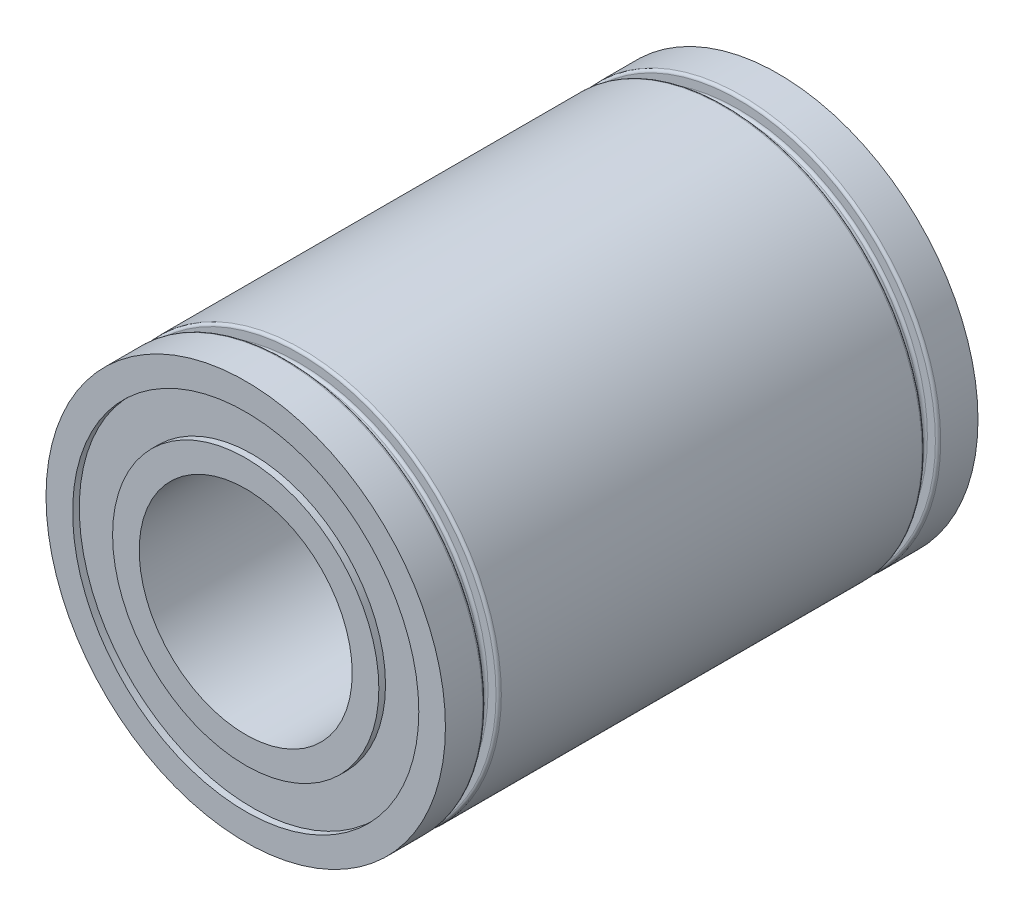
ISO-10303-21;
HEADER;
FILE_DESCRIPTION(('STEP AP214'),'2;1');
FILE_NAME('part.step','',(''),(''),'','','');
FILE_SCHEMA(('AUTOMOTIVE_DESIGN { 1 0 10303 214 1 1 1 1 }'));
ENDSEC;
DATA;
#1=APPLICATION_CONTEXT('core data for automotive mechanical design processes');
#2=APPLICATION_PROTOCOL_DEFINITION('international standard','automotive_design',2000,#1);
#3=PRODUCT_CONTEXT('',#1,'mechanical');
#4=PRODUCT('Part','Part','',(#3));
#5=PRODUCT_RELATED_PRODUCT_CATEGORY('part','',(#4));
#6=PRODUCT_DEFINITION_FORMATION('','',#4);
#7=PRODUCT_DEFINITION_CONTEXT('part definition',#1,'design');
#8=PRODUCT_DEFINITION('design','',#6,#7);
#9=PRODUCT_DEFINITION_SHAPE('','',#8);
#10=(LENGTH_UNIT() NAMED_UNIT(*) SI_UNIT(.MILLI.,.METRE.));
#11=(NAMED_UNIT(*) PLANE_ANGLE_UNIT() SI_UNIT($,.RADIAN.));
#12=(NAMED_UNIT(*) SI_UNIT($,.STERADIAN.) SOLID_ANGLE_UNIT());
#13=UNCERTAINTY_MEASURE_WITH_UNIT(LENGTH_MEASURE(1.E-05),#10,'distance_accuracy_value','');
#14=(GEOMETRIC_REPRESENTATION_CONTEXT(3) GLOBAL_UNCERTAINTY_ASSIGNED_CONTEXT((#13)) GLOBAL_UNIT_ASSIGNED_CONTEXT((#10,
#11,#12)) REPRESENTATION_CONTEXT('',''));
#15=CARTESIAN_POINT('',(0.,0.,0.));
#16=DIRECTION('',(0.,0.,1.));
#17=DIRECTION('',(1.,0.,0.));
#18=AXIS2_PLACEMENT_3D('',#15,#16,#17);
#19=CARTESIAN_POINT('',(0.,0.,10.));
#20=DIRECTION('',(0.,0.,-1.));
#21=DIRECTION('',(-1.,0.,0.));
#22=AXIS2_PLACEMENT_3D('',#19,#20,#21);
#23=CYLINDRICAL_SURFACE('',#22,7.5);
#24=CARTESIAN_POINT('',(0.,0.,-8.6));
#25=DIRECTION('',(0.,0.,1.));
#26=DIRECTION('',(1.,0.,0.));
#27=AXIS2_PLACEMENT_3D('',#24,#25,#26);
#28=CIRCLE('',#27,7.5);
#29=CARTESIAN_POINT('',(7.5,0.,-8.6));
#30=VERTEX_POINT('',#29);
#31=EDGE_CURVE('E93',#30,#30,#28,.F.);
#32=ORIENTED_EDGE('',*,*,#31,.T.);
#33=EDGE_LOOP('',(#32));
#34=FACE_BOUND('',#33,.T.);
#35=CARTESIAN_POINT('',(0.,0.,-10.));
#36=DIRECTION('',(0.,0.,1.));
#37=DIRECTION('',(1.,0.,0.));
#38=AXIS2_PLACEMENT_3D('',#35,#36,#37);
#39=CIRCLE('',#38,7.5);
#40=CARTESIAN_POINT('',(7.5,0.,-10.));
#41=VERTEX_POINT('',#40);
#42=EDGE_CURVE('E133',#41,#41,#39,.T.);
#43=ORIENTED_EDGE('',*,*,#42,.T.);
#44=EDGE_LOOP('',(#43));
#45=FACE_BOUND('',#44,.T.);
#46=ADVANCED_FACE('F52',(#34,#45),#23,.T.);
#47=CARTESIAN_POINT('',(0.,0.,8.6));
#48=DIRECTION('',(0.,0.,-1.));
#49=DIRECTION('',(-1.,0.,0.));
#50=AXIS2_PLACEMENT_3D('',#47,#48,#49);
#51=CIRCLE('',#50,7.5);
#52=CARTESIAN_POINT('',(-7.5,0.,8.6));
#53=VERTEX_POINT('',#52);
#54=EDGE_CURVE('E13',#53,#53,#51,.F.);
#55=ORIENTED_EDGE('',*,*,#54,.T.);
#56=EDGE_LOOP('',(#55));
#57=FACE_BOUND('',#56,.T.);
#58=CARTESIAN_POINT('',(0.,0.,10.));
#59=DIRECTION('',(0.,0.,1.));
#60=DIRECTION('',(1.,0.,0.));
#61=AXIS2_PLACEMENT_3D('',#58,#59,#60);
#62=CIRCLE('',#61,7.5);
#63=CARTESIAN_POINT('',(7.5,0.,10.));
#64=VERTEX_POINT('',#63);
#65=EDGE_CURVE('E132',#64,#64,#62,.T.);
#66=ORIENTED_EDGE('',*,*,#65,.F.);
#67=EDGE_LOOP('',(#66));
#68=FACE_BOUND('',#67,.T.);
#69=ADVANCED_FACE('F154',(#57,#68),#23,.T.);
#70=CARTESIAN_POINT('',(0.,0.,10.));
#71=DIRECTION('',(0.,0.,-1.));
#72=DIRECTION('',(-1.,0.,0.));
#73=AXIS2_PLACEMENT_3D('',#70,#71,#72);
#74=CYLINDRICAL_SURFACE('',#73,5.);
#75=CARTESIAN_POINT('',(0.,0.,-10.));
#76=DIRECTION('',(0.,0.,1.));
#77=DIRECTION('',(1.,0.,0.));
#78=AXIS2_PLACEMENT_3D('',#75,#76,#77);
#79=CIRCLE('',#78,5.);
#80=CARTESIAN_POINT('',(5.,0.,-10.));
#81=VERTEX_POINT('',#80);
#82=EDGE_CURVE('E112',#81,#81,#79,.T.);
#83=ORIENTED_EDGE('',*,*,#82,.T.);
#84=EDGE_LOOP('',(#83));
#85=FACE_BOUND('',#84,.T.);
#86=CARTESIAN_POINT('',(0.,0.,-9.75));
#87=DIRECTION('',(0.,0.,1.));
#88=DIRECTION('',(1.,0.,0.));
#89=AXIS2_PLACEMENT_3D('',#86,#87,#88);
#90=CIRCLE('',#89,5.);
#91=CARTESIAN_POINT('',(5.,0.,-9.75));
#92=VERTEX_POINT('',#91);
#93=EDGE_CURVE('E108',#92,#92,#90,.T.);
#94=ORIENTED_EDGE('',*,*,#93,.F.);
#95=EDGE_LOOP('',(#94));
#96=FACE_BOUND('',#95,.T.);
#97=ADVANCED_FACE('F156',(#85,#96),#74,.T.);
#98=CARTESIAN_POINT('',(0.,0.,10.));
#99=DIRECTION('',(0.,0.,-1.));
#100=DIRECTION('',(-1.,0.,0.));
#101=AXIS2_PLACEMENT_3D('',#98,#99,#100);
#102=CYLINDRICAL_SURFACE('',#101,4.);
#103=CARTESIAN_POINT('',(0.,0.,10.));
#104=DIRECTION('',(0.,0.,1.));
#105=DIRECTION('',(1.,0.,0.));
#106=AXIS2_PLACEMENT_3D('',#103,#104,#105);
#107=CIRCLE('',#106,4.);
#108=CARTESIAN_POINT('',(4.,0.,10.));
#109=VERTEX_POINT('',#108);
#110=EDGE_CURVE('E115',#109,#109,#107,.T.);
#111=ORIENTED_EDGE('',*,*,#110,.T.);
#112=EDGE_LOOP('',(#111));
#113=FACE_BOUND('',#112,.T.);
#114=CARTESIAN_POINT('',(0.,0.,-10.));
#115=DIRECTION('',(0.,0.,1.));
#116=DIRECTION('',(1.,0.,0.));
#117=AXIS2_PLACEMENT_3D('',#114,#115,#116);
#118=CIRCLE('',#117,4.);
#119=CARTESIAN_POINT('',(4.,0.,-10.));
#120=VERTEX_POINT('',#119);
#121=EDGE_CURVE('E116',#120,#120,#118,.T.);
#122=ORIENTED_EDGE('',*,*,#121,.F.);
#123=EDGE_LOOP('',(#122));
#124=FACE_BOUND('',#123,.T.);
#125=ADVANCED_FACE('F163',(#113,#124),#102,.F.);
#126=CARTESIAN_POINT('',(0.,0.,9.75));
#127=DIRECTION('',(0.,0.,1.));
#128=DIRECTION('',(1.,0.,0.));
#129=AXIS2_PLACEMENT_3D('',#126,#127,#128);
#130=CIRCLE('',#129,5.);
#131=CARTESIAN_POINT('',(5.,0.,9.75));
#132=VERTEX_POINT('',#131);
#133=EDGE_CURVE('E119',#132,#132,#130,.T.);
#134=ORIENTED_EDGE('',*,*,#133,.T.);
#135=EDGE_LOOP('',(#134));
#136=FACE_BOUND('',#135,.T.);
#137=CARTESIAN_POINT('',(0.,0.,10.));
#138=DIRECTION('',(0.,0.,1.));
#139=DIRECTION('',(1.,0.,0.));
#140=AXIS2_PLACEMENT_3D('',#137,#138,#139);
#141=CIRCLE('',#140,5.);
#142=CARTESIAN_POINT('',(5.,0.,10.));
#143=VERTEX_POINT('',#142);
#144=EDGE_CURVE('E111',#143,#143,#141,.T.);
#145=ORIENTED_EDGE('',*,*,#144,.F.);
#146=EDGE_LOOP('',(#145));
#147=FACE_BOUND('',#146,.T.);
#148=ADVANCED_FACE('F166',(#136,#147),#74,.T.);
#149=CARTESIAN_POINT('',(0.,0.,10.));
#150=DIRECTION('',(0.,0.,1.));
#151=DIRECTION('',(1.,0.,0.));
#152=AXIS2_PLACEMENT_3D('',#149,#150,#151);
#153=PLANE('',#152);
#154=ORIENTED_EDGE('',*,*,#110,.F.);
#155=EDGE_LOOP('',(#154));
#156=FACE_BOUND('',#155,.T.);
#157=ORIENTED_EDGE('',*,*,#144,.T.);
#158=EDGE_LOOP('',(#157));
#159=FACE_BOUND('',#158,.T.);
#160=ADVANCED_FACE('F387',(#156,#159),#153,.T.);
#161=CARTESIAN_POINT('',(0.,0.,-10.));
#162=DIRECTION('',(0.,0.,1.));
#163=DIRECTION('',(1.,0.,0.));
#164=AXIS2_PLACEMENT_3D('',#161,#162,#163);
#165=PLANE('',#164);
#166=ORIENTED_EDGE('',*,*,#121,.T.);
#167=EDGE_LOOP('',(#166));
#168=FACE_BOUND('',#167,.T.);
#169=ORIENTED_EDGE('',*,*,#82,.F.);
#170=EDGE_LOOP('',(#169));
#171=FACE_BOUND('',#170,.T.);
#172=ADVANCED_FACE('F350',(#168,#171),#165,.F.);
#173=CARTESIAN_POINT('',(0.,0.,9.75));
#174=DIRECTION('',(0.,0.,1.));
#175=DIRECTION('',(1.,0.,0.));
#176=AXIS2_PLACEMENT_3D('',#173,#174,#175);
#177=PLANE('',#176);
#178=ORIENTED_EDGE('',*,*,#133,.F.);
#179=EDGE_LOOP('',(#178));
#180=FACE_BOUND('',#179,.T.);
#181=CARTESIAN_POINT('',(0.,0.,9.75));
#182=DIRECTION('',(0.,0.,1.));
#183=DIRECTION('',(1.,0.,0.));
#184=AXIS2_PLACEMENT_3D('',#181,#182,#183);
#185=CIRCLE('',#184,6.5);
#186=CARTESIAN_POINT('',(6.5,0.,9.75));
#187=VERTEX_POINT('',#186);
#188=EDGE_CURVE('E127',#187,#187,#185,.F.);
#189=ORIENTED_EDGE('',*,*,#188,.F.);
#190=EDGE_LOOP('',(#189));
#191=FACE_BOUND('',#190,.T.);
#192=ADVANCED_FACE('F340',(#180,#191),#177,.T.);
#193=CARTESIAN_POINT('',(0.,0.,-9.75));
#194=DIRECTION('',(0.,0.,1.));
#195=DIRECTION('',(1.,0.,0.));
#196=AXIS2_PLACEMENT_3D('',#193,#194,#195);
#197=PLANE('',#196);
#198=ORIENTED_EDGE('',*,*,#93,.T.);
#199=EDGE_LOOP('',(#198));
#200=FACE_BOUND('',#199,.T.);
#201=CARTESIAN_POINT('',(0.,0.,-9.75));
#202=DIRECTION('',(0.,0.,1.));
#203=DIRECTION('',(1.,0.,0.));
#204=AXIS2_PLACEMENT_3D('',#201,#202,#203);
#205=CIRCLE('',#204,6.5);
#206=CARTESIAN_POINT('',(6.5,0.,-9.75));
#207=VERTEX_POINT('',#206);
#208=EDGE_CURVE('E124',#207,#207,#205,.T.);
#209=ORIENTED_EDGE('',*,*,#208,.F.);
#210=EDGE_LOOP('',(#209));
#211=FACE_BOUND('',#210,.T.);
#212=ADVANCED_FACE('F333',(#200,#211),#197,.F.);
#213=CARTESIAN_POINT('',(0.,0.,10.));
#214=DIRECTION('',(0.,0.,-1.));
#215=DIRECTION('',(-1.,0.,0.));
#216=AXIS2_PLACEMENT_3D('',#213,#214,#215);
#217=CYLINDRICAL_SURFACE('',#216,6.5);
#218=CARTESIAN_POINT('',(0.,0.,-10.));
#219=DIRECTION('',(0.,0.,1.));
#220=DIRECTION('',(1.,0.,0.));
#221=AXIS2_PLACEMENT_3D('',#218,#219,#220);
#222=CIRCLE('',#221,6.5);
#223=CARTESIAN_POINT('',(6.5,0.,-10.));
#224=VERTEX_POINT('',#223);
#225=EDGE_CURVE('E137',#224,#224,#222,.T.);
#226=ORIENTED_EDGE('',*,*,#225,.F.);
#227=EDGE_LOOP('',(#226));
#228=FACE_BOUND('',#227,.T.);
#229=ORIENTED_EDGE('',*,*,#208,.T.);
#230=EDGE_LOOP('',(#229));
#231=FACE_BOUND('',#230,.T.);
#232=ADVANCED_FACE('F339',(#228,#231),#217,.F.);
#233=ORIENTED_EDGE('',*,*,#188,.T.);
#234=EDGE_LOOP('',(#233));
#235=FACE_BOUND('',#234,.T.);
#236=CARTESIAN_POINT('',(0.,0.,10.));
#237=DIRECTION('',(0.,0.,1.));
#238=DIRECTION('',(1.,0.,0.));
#239=AXIS2_PLACEMENT_3D('',#236,#237,#238);
#240=CIRCLE('',#239,6.5);
#241=CARTESIAN_POINT('',(6.5,0.,10.));
#242=VERTEX_POINT('',#241);
#243=EDGE_CURVE('E136',#242,#242,#240,.T.);
#244=ORIENTED_EDGE('',*,*,#243,.T.);
#245=EDGE_LOOP('',(#244));
#246=FACE_BOUND('',#245,.T.);
#247=ADVANCED_FACE('F145',(#235,#246),#217,.F.);
#248=CARTESIAN_POINT('',(0.,0.,10.));
#249=DIRECTION('',(0.,0.,1.));
#250=DIRECTION('',(1.,0.,0.));
#251=AXIS2_PLACEMENT_3D('',#248,#249,#250);
#252=PLANE('',#251);
#253=ORIENTED_EDGE('',*,*,#243,.F.);
#254=EDGE_LOOP('',(#253));
#255=FACE_BOUND('',#254,.T.);
#256=ORIENTED_EDGE('',*,*,#65,.T.);
#257=EDGE_LOOP('',(#256));
#258=FACE_BOUND('',#257,.T.);
#259=ADVANCED_FACE('F147',(#255,#258),#252,.T.);
#260=CARTESIAN_POINT('',(0.,0.,-10.));
#261=DIRECTION('',(0.,0.,1.));
#262=DIRECTION('',(1.,0.,0.));
#263=AXIS2_PLACEMENT_3D('',#260,#261,#262);
#264=PLANE('',#263);
#265=ORIENTED_EDGE('',*,*,#225,.T.);
#266=EDGE_LOOP('',(#265));
#267=FACE_BOUND('',#266,.T.);
#268=ORIENTED_EDGE('',*,*,#42,.F.);
#269=EDGE_LOOP('',(#268));
#270=FACE_BOUND('',#269,.T.);
#271=ADVANCED_FACE('F150',(#267,#270),#264,.F.);
#272=CARTESIAN_POINT('',(7.,0.,8.));
#273=DIRECTION('',(0.,0.,1.));
#274=DIRECTION('',(1.,0.,0.));
#275=AXIS2_PLACEMENT_3D('',#272,#273,#274);
#276=PLANE('',#275);
#277=CARTESIAN_POINT('',(0.,0.,8.));
#278=DIRECTION('',(0.,0.,1.));
#279=DIRECTION('',(1.,0.,0.));
#280=AXIS2_PLACEMENT_3D('',#277,#278,#279);
#281=CIRCLE('',#280,7.1);
#282=CARTESIAN_POINT('',(7.1,0.,8.));
#283=VERTEX_POINT('',#282);
#284=EDGE_CURVE('E59',#283,#283,#281,.F.);
#285=ORIENTED_EDGE('',*,*,#284,.T.);
#286=EDGE_LOOP('',(#285));
#287=FACE_BOUND('',#286,.T.);
#288=CARTESIAN_POINT('',(0.,0.,8.));
#289=DIRECTION('',(0.,0.,1.));
#290=DIRECTION('',(1.,0.,0.));
#291=AXIS2_PLACEMENT_3D('',#288,#289,#290);
#292=CIRCLE('',#291,7.4);
#293=CARTESIAN_POINT('',(7.4,0.,8.));
#294=VERTEX_POINT('',#293);
#295=EDGE_CURVE('E63',#294,#294,#292,.T.);
#296=ORIENTED_EDGE('',*,*,#295,.T.);
#297=EDGE_LOOP('',(#296));
#298=FACE_BOUND('',#297,.T.);
#299=ADVANCED_FACE('F194',(#287,#298),#276,.T.);
#300=CARTESIAN_POINT('',(7.,0.,8.5));
#301=DIRECTION('',(0.,0.,-1.));
#302=DIRECTION('',(-1.,0.,0.));
#303=AXIS2_PLACEMENT_3D('',#300,#301,#302);
#304=PLANE('',#303);
#305=CARTESIAN_POINT('',(0.,0.,8.5));
#306=DIRECTION('',(0.,0.,-1.));
#307=DIRECTION('',(-1.,0.,0.));
#308=AXIS2_PLACEMENT_3D('',#305,#306,#307);
#309=CIRCLE('',#308,7.1);
#310=CARTESIAN_POINT('',(-7.1,0.,8.5));
#311=VERTEX_POINT('',#310);
#312=EDGE_CURVE('E67',#311,#311,#309,.F.);
#313=ORIENTED_EDGE('',*,*,#312,.T.);
#314=EDGE_LOOP('',(#313));
#315=FACE_BOUND('',#314,.T.);
#316=CARTESIAN_POINT('',(0.,0.,8.5));
#317=DIRECTION('',(0.,0.,-1.));
#318=DIRECTION('',(-1.,0.,0.));
#319=AXIS2_PLACEMENT_3D('',#316,#317,#318);
#320=CIRCLE('',#319,7.4);
#321=CARTESIAN_POINT('',(-7.4,0.,8.5));
#322=VERTEX_POINT('',#321);
#323=EDGE_CURVE('E72',#322,#322,#320,.T.);
#324=ORIENTED_EDGE('',*,*,#323,.T.);
#325=EDGE_LOOP('',(#324));
#326=FACE_BOUND('',#325,.T.);
#327=ADVANCED_FACE('F181',(#315,#326),#304,.T.);
#328=CARTESIAN_POINT('',(0.,0.,-10.));
#329=DIRECTION('',(0.,0.,-1.));
#330=DIRECTION('',(-1.,0.,0.));
#331=AXIS2_PLACEMENT_3D('',#328,#329,#330);
#332=CYLINDRICAL_SURFACE('',#331,7.);
#333=CARTESIAN_POINT('',(0.,0.,8.4));
#334=DIRECTION('',(0.,0.,-1.));
#335=DIRECTION('',(-1.,0.,0.));
#336=AXIS2_PLACEMENT_3D('',#333,#334,#335);
#337=CIRCLE('',#336,7.);
#338=CARTESIAN_POINT('',(-7.,0.,8.4));
#339=VERTEX_POINT('',#338);
#340=EDGE_CURVE('E75',#339,#339,#337,.T.);
#341=ORIENTED_EDGE('',*,*,#340,.T.);
#342=EDGE_LOOP('',(#341));
#343=FACE_BOUND('',#342,.T.);
#344=CARTESIAN_POINT('',(0.,0.,8.1));
#345=DIRECTION('',(0.,0.,1.));
#346=DIRECTION('',(1.,0.,0.));
#347=AXIS2_PLACEMENT_3D('',#344,#345,#346);
#348=CIRCLE('',#347,7.);
#349=CARTESIAN_POINT('',(7.,0.,8.1));
#350=VERTEX_POINT('',#349);
#351=EDGE_CURVE('E78',#350,#350,#348,.T.);
#352=ORIENTED_EDGE('',*,*,#351,.T.);
#353=EDGE_LOOP('',(#352));
#354=FACE_BOUND('',#353,.T.);
#355=ADVANCED_FACE('F172',(#343,#354),#332,.T.);
#356=CARTESIAN_POINT('',(0.,0.,-7.9));
#357=DIRECTION('',(0.,0.,-1.));
#358=DIRECTION('',(-1.,0.,0.));
#359=AXIS2_PLACEMENT_3D('',#356,#357,#358);
#360=CIRCLE('',#359,7.5);
#361=CARTESIAN_POINT('',(-7.5,0.,-7.9));
#362=VERTEX_POINT('',#361);
#363=EDGE_CURVE('E81',#362,#362,#360,.F.);
#364=ORIENTED_EDGE('',*,*,#363,.T.);
#365=EDGE_LOOP('',(#364));
#366=FACE_BOUND('',#365,.T.);
#367=CARTESIAN_POINT('',(0.,0.,7.9));
#368=DIRECTION('',(0.,0.,1.));
#369=DIRECTION('',(1.,0.,0.));
#370=AXIS2_PLACEMENT_3D('',#367,#368,#369);
#371=CIRCLE('',#370,7.5);
#372=CARTESIAN_POINT('',(7.5,0.,7.9));
#373=VERTEX_POINT('',#372);
#374=EDGE_CURVE('E84',#373,#373,#371,.F.);
#375=ORIENTED_EDGE('',*,*,#374,.T.);
#376=EDGE_LOOP('',(#375));
#377=FACE_BOUND('',#376,.T.);
#378=ADVANCED_FACE('F158',(#366,#377),#23,.T.);
#379=CARTESIAN_POINT('',(7.,0.,-8.5));
#380=DIRECTION('',(0.,0.,1.));
#381=DIRECTION('',(1.,0.,0.));
#382=AXIS2_PLACEMENT_3D('',#379,#380,#381);
#383=PLANE('',#382);
#384=CARTESIAN_POINT('',(0.,0.,-8.5));
#385=DIRECTION('',(0.,0.,1.));
#386=DIRECTION('',(1.,0.,0.));
#387=AXIS2_PLACEMENT_3D('',#384,#385,#386);
#388=CIRCLE('',#387,7.1);
#389=CARTESIAN_POINT('',(7.1,0.,-8.5));
#390=VERTEX_POINT('',#389);
#391=EDGE_CURVE('E102',#390,#390,#388,.F.);
#392=ORIENTED_EDGE('',*,*,#391,.T.);
#393=EDGE_LOOP('',(#392));
#394=FACE_BOUND('',#393,.T.);
#395=CARTESIAN_POINT('',(0.,0.,-8.5));
#396=DIRECTION('',(0.,0.,1.));
#397=DIRECTION('',(1.,0.,0.));
#398=AXIS2_PLACEMENT_3D('',#395,#396,#397);
#399=CIRCLE('',#398,7.4);
#400=CARTESIAN_POINT('',(7.4,0.,-8.5));
#401=VERTEX_POINT('',#400);
#402=EDGE_CURVE('E105',#401,#401,#399,.T.);
#403=ORIENTED_EDGE('',*,*,#402,.T.);
#404=EDGE_LOOP('',(#403));
#405=FACE_BOUND('',#404,.T.);
#406=ADVANCED_FACE('F171',(#394,#405),#383,.T.);
#407=CARTESIAN_POINT('',(7.,0.,-8.));
#408=DIRECTION('',(0.,0.,-1.));
#409=DIRECTION('',(-1.,0.,0.));
#410=AXIS2_PLACEMENT_3D('',#407,#408,#409);
#411=PLANE('',#410);
#412=CARTESIAN_POINT('',(0.,0.,-8.));
#413=DIRECTION('',(0.,0.,-1.));
#414=DIRECTION('',(-1.,0.,0.));
#415=AXIS2_PLACEMENT_3D('',#412,#413,#414);
#416=CIRCLE('',#415,7.1);
#417=CARTESIAN_POINT('',(-7.1,0.,-8.));
#418=VERTEX_POINT('',#417);
#419=EDGE_CURVE('E87',#418,#418,#416,.F.);
#420=ORIENTED_EDGE('',*,*,#419,.T.);
#421=EDGE_LOOP('',(#420));
#422=FACE_BOUND('',#421,.T.);
#423=CARTESIAN_POINT('',(0.,0.,-8.));
#424=DIRECTION('',(0.,0.,-1.));
#425=DIRECTION('',(-1.,0.,0.));
#426=AXIS2_PLACEMENT_3D('',#423,#424,#425);
#427=CIRCLE('',#426,7.4);
#428=CARTESIAN_POINT('',(-7.4,0.,-8.));
#429=VERTEX_POINT('',#428);
#430=EDGE_CURVE('E90',#429,#429,#427,.T.);
#431=ORIENTED_EDGE('',*,*,#430,.T.);
#432=EDGE_LOOP('',(#431));
#433=FACE_BOUND('',#432,.T.);
#434=ADVANCED_FACE('F178',(#422,#433),#411,.T.);
#435=CARTESIAN_POINT('',(0.,0.,-10.));
#436=DIRECTION('',(0.,0.,-1.));
#437=DIRECTION('',(-1.,0.,0.));
#438=AXIS2_PLACEMENT_3D('',#435,#436,#437);
#439=CYLINDRICAL_SURFACE('',#438,7.);
#440=CARTESIAN_POINT('',(0.,0.,-8.4));
#441=DIRECTION('',(0.,0.,1.));
#442=DIRECTION('',(1.,0.,0.));
#443=AXIS2_PLACEMENT_3D('',#440,#441,#442);
#444=CIRCLE('',#443,7.);
#445=CARTESIAN_POINT('',(7.,0.,-8.4));
#446=VERTEX_POINT('',#445);
#447=EDGE_CURVE('E96',#446,#446,#444,.T.);
#448=ORIENTED_EDGE('',*,*,#447,.T.);
#449=EDGE_LOOP('',(#448));
#450=FACE_BOUND('',#449,.T.);
#451=CARTESIAN_POINT('',(0.,0.,-8.1));
#452=DIRECTION('',(0.,0.,-1.));
#453=DIRECTION('',(-1.,0.,0.));
#454=AXIS2_PLACEMENT_3D('',#451,#452,#453);
#455=CIRCLE('',#454,7.);
#456=CARTESIAN_POINT('',(-7.,0.,-8.1));
#457=VERTEX_POINT('',#456);
#458=EDGE_CURVE('E99',#457,#457,#455,.T.);
#459=ORIENTED_EDGE('',*,*,#458,.T.);
#460=EDGE_LOOP('',(#459));
#461=FACE_BOUND('',#460,.T.);
#462=ADVANCED_FACE('F205',(#450,#461),#439,.T.);
#463=CARTESIAN_POINT('',(0.,0.,-8.4));
#464=DIRECTION('',(0.,0.,1.));
#465=DIRECTION('',(1.,0.,0.));
#466=AXIS2_PLACEMENT_3D('',#463,#464,#465);
#467=TOROIDAL_SURFACE('',#466,7.1,0.1);
#468=ORIENTED_EDGE('',*,*,#447,.F.);
#469=EDGE_LOOP('',(#468));
#470=FACE_BOUND('',#469,.T.);
#471=ORIENTED_EDGE('',*,*,#391,.F.);
#472=EDGE_LOOP('',(#471));
#473=FACE_BOUND('',#472,.T.);
#474=ADVANCED_FACE('F208',(#470,#473),#467,.F.);
#475=CARTESIAN_POINT('',(0.,0.,-8.6));
#476=DIRECTION('',(0.,0.,1.));
#477=DIRECTION('',(1.,0.,0.));
#478=AXIS2_PLACEMENT_3D('',#475,#476,#477);
#479=TOROIDAL_SURFACE('',#478,7.4,0.1);
#480=ORIENTED_EDGE('',*,*,#31,.F.);
#481=EDGE_LOOP('',(#480));
#482=FACE_BOUND('',#481,.T.);
#483=ORIENTED_EDGE('',*,*,#402,.F.);
#484=EDGE_LOOP('',(#483));
#485=FACE_BOUND('',#484,.T.);
#486=ADVANCED_FACE('F230',(#482,#485),#479,.T.);
#487=CARTESIAN_POINT('',(0.,0.,-8.1));
#488=DIRECTION('',(0.,0.,-1.));
#489=DIRECTION('',(-1.,0.,0.));
#490=AXIS2_PLACEMENT_3D('',#487,#488,#489);
#491=TOROIDAL_SURFACE('',#490,7.1,0.1);
#492=ORIENTED_EDGE('',*,*,#419,.F.);
#493=EDGE_LOOP('',(#492));
#494=FACE_BOUND('',#493,.T.);
#495=ORIENTED_EDGE('',*,*,#458,.F.);
#496=EDGE_LOOP('',(#495));
#497=FACE_BOUND('',#496,.T.);
#498=ADVANCED_FACE('F221',(#494,#497),#491,.F.);
#499=CARTESIAN_POINT('',(0.,0.,-7.9));
#500=DIRECTION('',(0.,0.,-1.));
#501=DIRECTION('',(-1.,0.,0.));
#502=AXIS2_PLACEMENT_3D('',#499,#500,#501);
#503=TOROIDAL_SURFACE('',#502,7.4,0.1);
#504=ORIENTED_EDGE('',*,*,#363,.F.);
#505=EDGE_LOOP('',(#504));
#506=FACE_BOUND('',#505,.T.);
#507=ORIENTED_EDGE('',*,*,#430,.F.);
#508=EDGE_LOOP('',(#507));
#509=FACE_BOUND('',#508,.T.);
#510=ADVANCED_FACE('F218',(#506,#509),#503,.T.);
#511=CARTESIAN_POINT('',(0.,0.,8.4));
#512=DIRECTION('',(0.,0.,-1.));
#513=DIRECTION('',(-1.,0.,0.));
#514=AXIS2_PLACEMENT_3D('',#511,#512,#513);
#515=TOROIDAL_SURFACE('',#514,7.1,0.1);
#516=ORIENTED_EDGE('',*,*,#312,.F.);
#517=EDGE_LOOP('',(#516));
#518=FACE_BOUND('',#517,.T.);
#519=ORIENTED_EDGE('',*,*,#340,.F.);
#520=EDGE_LOOP('',(#519));
#521=FACE_BOUND('',#520,.T.);
#522=ADVANCED_FACE('F220',(#518,#521),#515,.F.);
#523=CARTESIAN_POINT('',(0.,0.,8.1));
#524=DIRECTION('',(0.,0.,1.));
#525=DIRECTION('',(1.,0.,0.));
#526=AXIS2_PLACEMENT_3D('',#523,#524,#525);
#527=TOROIDAL_SURFACE('',#526,7.1,0.1);
#528=ORIENTED_EDGE('',*,*,#351,.F.);
#529=EDGE_LOOP('',(#528));
#530=FACE_BOUND('',#529,.T.);
#531=ORIENTED_EDGE('',*,*,#284,.F.);
#532=EDGE_LOOP('',(#531));
#533=FACE_BOUND('',#532,.T.);
#534=ADVANCED_FACE('F191',(#530,#533),#527,.F.);
#535=CARTESIAN_POINT('',(0.,0.,7.9));
#536=DIRECTION('',(0.,0.,1.));
#537=DIRECTION('',(1.,0.,0.));
#538=AXIS2_PLACEMENT_3D('',#535,#536,#537);
#539=TOROIDAL_SURFACE('',#538,7.4,0.1);
#540=ORIENTED_EDGE('',*,*,#374,.F.);
#541=EDGE_LOOP('',(#540));
#542=FACE_BOUND('',#541,.T.);
#543=ORIENTED_EDGE('',*,*,#295,.F.);
#544=EDGE_LOOP('',(#543));
#545=FACE_BOUND('',#544,.T.);
#546=ADVANCED_FACE('F188',(#542,#545),#539,.T.);
#547=CARTESIAN_POINT('',(0.,0.,8.6));
#548=DIRECTION('',(0.,0.,-1.));
#549=DIRECTION('',(-1.,0.,0.));
#550=AXIS2_PLACEMENT_3D('',#547,#548,#549);
#551=TOROIDAL_SURFACE('',#550,7.4,0.1);
#552=ORIENTED_EDGE('',*,*,#54,.F.);
#553=EDGE_LOOP('',(#552));
#554=FACE_BOUND('',#553,.T.);
#555=ORIENTED_EDGE('',*,*,#323,.F.);
#556=EDGE_LOOP('',(#555));
#557=FACE_BOUND('',#556,.T.);
#558=ADVANCED_FACE('F54',(#554,#557),#551,.T.);
#559=CLOSED_SHELL('',(#46,#69,#97,#125,#148,#160,#172,#192,#212,#232,#247,#259,#271,#299,#327,
#355,#378,#406,#434,#462,#474,#486,#498,#510,#522,#534,#546,#558));
#560=MANIFOLD_SOLID_BREP('B2',#559);
#561=ADVANCED_BREP_SHAPE_REPRESENTATION('',(#18,#560),#14);
#562=SHAPE_DEFINITION_REPRESENTATION(#9,#561);
ENDSEC;
END-ISO-10303-21;
